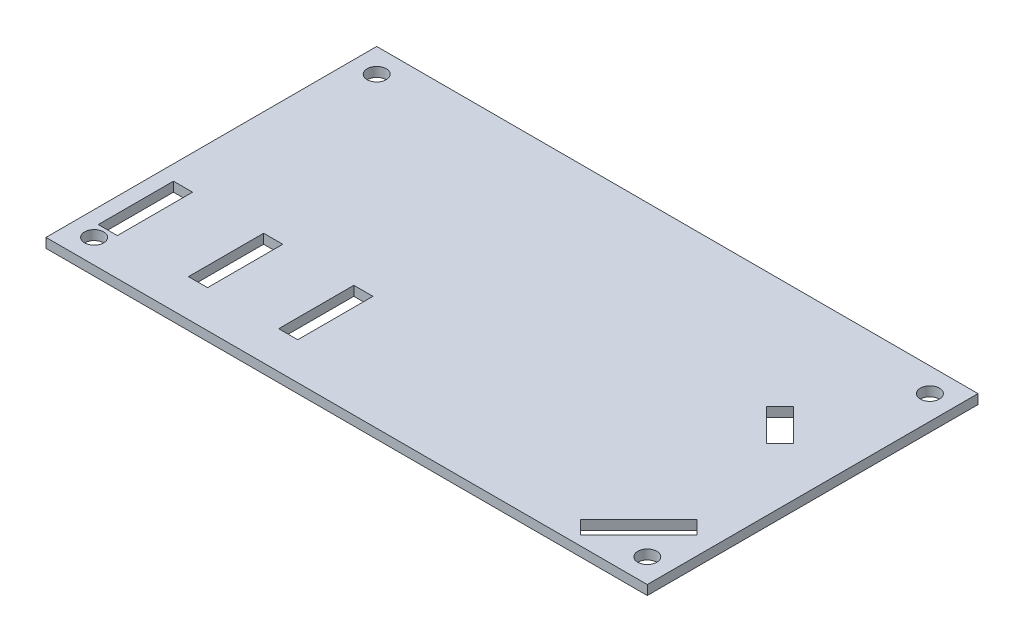
ISO-10303-21;
HEADER;
FILE_DESCRIPTION(('STEP AP214'),'2;1');
FILE_NAME('part.step','',(''),(''),'','','');
FILE_SCHEMA(('AUTOMOTIVE_DESIGN { 1 0 10303 214 1 1 1 1 }'));
ENDSEC;
DATA;
#1=APPLICATION_CONTEXT('core data for automotive mechanical design processes');
#2=APPLICATION_PROTOCOL_DEFINITION('international standard','automotive_design',2000,#1);
#3=PRODUCT_CONTEXT('',#1,'mechanical');
#4=PRODUCT('Part','Part','',(#3));
#5=PRODUCT_RELATED_PRODUCT_CATEGORY('part','',(#4));
#6=PRODUCT_DEFINITION_FORMATION('','',#4);
#7=PRODUCT_DEFINITION_CONTEXT('part definition',#1,'design');
#8=PRODUCT_DEFINITION('design','',#6,#7);
#9=PRODUCT_DEFINITION_SHAPE('','',#8);
#10=(LENGTH_UNIT() NAMED_UNIT(*) SI_UNIT(.MILLI.,.METRE.));
#11=(NAMED_UNIT(*) PLANE_ANGLE_UNIT() SI_UNIT($,.RADIAN.));
#12=(NAMED_UNIT(*) SI_UNIT($,.STERADIAN.) SOLID_ANGLE_UNIT());
#13=UNCERTAINTY_MEASURE_WITH_UNIT(LENGTH_MEASURE(1.E-05),#10,'distance_accuracy_value','');
#14=(GEOMETRIC_REPRESENTATION_CONTEXT(3) GLOBAL_UNCERTAINTY_ASSIGNED_CONTEXT((#13)) GLOBAL_UNIT_ASSIGNED_CONTEXT((#10,
#11,#12)) REPRESENTATION_CONTEXT('',''));
#15=CARTESIAN_POINT('',(0.,0.,0.));
#16=DIRECTION('',(0.,0.,1.));
#17=DIRECTION('',(1.,0.,0.));
#18=AXIS2_PLACEMENT_3D('',#15,#16,#17);
#19=CARTESIAN_POINT('',(65.,-0.00100000000000013,-12.3891811277915));
#20=DIRECTION('',(0.,0.,1.));
#21=DIRECTION('',(1.,0.,0.));
#22=AXIS2_PLACEMENT_3D('',#19,#20,#21);
#23=PLANE('',#22);
#24=DIRECTION('',(0.,1.,0.));
#25=VECTOR('',#24,1.);
#26=CARTESIAN_POINT('',(65.,-0.00100000000000013,-12.3891811277915));
#27=LINE('',#26,#25);
#28=CARTESIAN_POINT('',(65.,0.,-12.3891811277915));
#29=VERTEX_POINT('',#28);
#30=CARTESIAN_POINT('',(65.,3.175,-12.3891811277915));
#31=VERTEX_POINT('',#30);
#32=EDGE_CURVE('E405',#29,#31,#27,.T.);
#33=ORIENTED_EDGE('',*,*,#32,.T.);
#34=DIRECTION('',(1.,0.,0.));
#35=VECTOR('',#34,1.);
#36=CARTESIAN_POINT('',(65.,3.175,-12.3891811277915));
#37=LINE('',#36,#35);
#38=CARTESIAN_POINT('',(71.35,3.175,-12.3891811277915));
#39=VERTEX_POINT('',#38);
#40=EDGE_CURVE('E394',#31,#39,#37,.T.);
#41=ORIENTED_EDGE('',*,*,#40,.T.);
#42=DIRECTION('',(0.,1.,0.));
#43=VECTOR('',#42,1.);
#44=CARTESIAN_POINT('',(71.35,-0.00100000000000013,-12.3891811277915));
#45=LINE('',#44,#43);
#46=CARTESIAN_POINT('',(71.35,0.,-12.3891811277915));
#47=VERTEX_POINT('',#46);
#48=EDGE_CURVE('E11',#47,#39,#45,.T.);
#49=ORIENTED_EDGE('',*,*,#48,.F.);
#50=DIRECTION('',(1.,0.,0.));
#51=VECTOR('',#50,1.);
#52=CARTESIAN_POINT('',(65.,0.,-12.3891811277915));
#53=LINE('',#52,#51);
#54=EDGE_CURVE('E398',#29,#47,#53,.T.);
#55=ORIENTED_EDGE('',*,*,#54,.F.);
#56=EDGE_LOOP('',(#33,#41,#49,#55));
#57=FACE_BOUND('',#56,.T.);
#58=ADVANCED_FACE('F33',(#57),#23,.F.);
#59=CARTESIAN_POINT('',(71.35,-0.00100000000000013,-37.3891811277915));
#60=DIRECTION('',(1.,0.,0.));
#61=DIRECTION('',(0.,0.,-1.));
#62=AXIS2_PLACEMENT_3D('',#59,#60,#61);
#63=PLANE('',#62);
#64=ORIENTED_EDGE('',*,*,#48,.T.);
#65=DIRECTION('',(0.,0.,-1.));
#66=VECTOR('',#65,1.);
#67=CARTESIAN_POINT('',(71.35,3.175,-37.3891811277915));
#68=LINE('',#67,#66);
#69=CARTESIAN_POINT('',(71.35,3.175,-37.3891811277915));
#70=VERTEX_POINT('',#69);
#71=EDGE_CURVE('E391',#39,#70,#68,.T.);
#72=ORIENTED_EDGE('',*,*,#71,.T.);
#73=DIRECTION('',(0.,1.,0.));
#74=VECTOR('',#73,1.);
#75=CARTESIAN_POINT('',(71.35,-0.00100000000000013,-37.3891811277915));
#76=LINE('',#75,#74);
#77=CARTESIAN_POINT('',(71.35,0.,-37.3891811277915));
#78=VERTEX_POINT('',#77);
#79=EDGE_CURVE('E40',#78,#70,#76,.T.);
#80=ORIENTED_EDGE('',*,*,#79,.F.);
#81=DIRECTION('',(0.,0.,-1.));
#82=VECTOR('',#81,1.);
#83=CARTESIAN_POINT('',(71.35,0.,-37.3891811277915));
#84=LINE('',#83,#82);
#85=EDGE_CURVE('E54',#47,#78,#84,.T.);
#86=ORIENTED_EDGE('',*,*,#85,.F.);
#87=EDGE_LOOP('',(#64,#72,#80,#86));
#88=FACE_BOUND('',#87,.T.);
#89=ADVANCED_FACE('F413',(#88),#63,.F.);
#90=CARTESIAN_POINT('',(65.,-0.00100000000000013,-37.3891811277915));
#91=DIRECTION('',(0.,0.,-1.));
#92=DIRECTION('',(-1.,0.,0.));
#93=AXIS2_PLACEMENT_3D('',#90,#91,#92);
#94=PLANE('',#93);
#95=ORIENTED_EDGE('',*,*,#79,.T.);
#96=DIRECTION('',(-1.,0.,0.));
#97=VECTOR('',#96,1.);
#98=CARTESIAN_POINT('',(65.,3.175,-37.3891811277915));
#99=LINE('',#98,#97);
#100=CARTESIAN_POINT('',(65.,3.175,-37.3891811277915));
#101=VERTEX_POINT('',#100);
#102=EDGE_CURVE('E388',#70,#101,#99,.T.);
#103=ORIENTED_EDGE('',*,*,#102,.T.);
#104=DIRECTION('',(0.,1.,0.));
#105=VECTOR('',#104,1.);
#106=CARTESIAN_POINT('',(65.,-0.00100000000000013,-37.3891811277915));
#107=LINE('',#106,#105);
#108=CARTESIAN_POINT('',(65.,0.,-37.3891811277915));
#109=VERTEX_POINT('',#108);
#110=EDGE_CURVE('E403',#109,#101,#107,.T.);
#111=ORIENTED_EDGE('',*,*,#110,.F.);
#112=DIRECTION('',(-1.,0.,0.));
#113=VECTOR('',#112,1.);
#114=CARTESIAN_POINT('',(65.,0.,-37.3891811277915));
#115=LINE('',#114,#113);
#116=EDGE_CURVE('E401',#78,#109,#115,.T.);
#117=ORIENTED_EDGE('',*,*,#116,.F.);
#118=EDGE_LOOP('',(#95,#103,#111,#117));
#119=FACE_BOUND('',#118,.T.);
#120=ADVANCED_FACE('F410',(#119),#94,.F.);
#121=CARTESIAN_POINT('',(65.,-0.00100000000000013,-37.3891811277915));
#122=DIRECTION('',(-1.,0.,0.));
#123=DIRECTION('',(0.,0.,1.));
#124=AXIS2_PLACEMENT_3D('',#121,#122,#123);
#125=PLANE('',#124);
#126=ORIENTED_EDGE('',*,*,#110,.T.);
#127=DIRECTION('',(0.,0.,1.));
#128=VECTOR('',#127,1.);
#129=CARTESIAN_POINT('',(65.,3.175,-37.3891811277915));
#130=LINE('',#129,#128);
#131=EDGE_CURVE('E376',#101,#31,#130,.T.);
#132=ORIENTED_EDGE('',*,*,#131,.T.);
#133=ORIENTED_EDGE('',*,*,#32,.F.);
#134=DIRECTION('',(0.,0.,1.));
#135=VECTOR('',#134,1.);
#136=CARTESIAN_POINT('',(65.,0.,-37.3891811277915));
#137=LINE('',#136,#135);
#138=EDGE_CURVE('E47',#109,#29,#137,.T.);
#139=ORIENTED_EDGE('',*,*,#138,.F.);
#140=EDGE_LOOP('',(#126,#132,#133,#139));
#141=FACE_BOUND('',#140,.T.);
#142=ADVANCED_FACE('F419',(#141),#125,.F.);
#143=CARTESIAN_POINT('',(0.,3.175,0.));
#144=DIRECTION('',(1.,0.,0.));
#145=DIRECTION('',(0.,0.,-1.));
#146=AXIS2_PLACEMENT_3D('',#143,#144,#145);
#147=PLANE('',#146);
#148=DIRECTION('',(0.,0.,1.));
#149=VECTOR('',#148,1.);
#150=CARTESIAN_POINT('',(0.,0.,0.));
#151=LINE('',#150,#149);
#152=CARTESIAN_POINT('',(0.,0.,-110.));
#153=VERTEX_POINT('',#152);
#154=CARTESIAN_POINT('',(0.,0.,0.));
#155=VERTEX_POINT('',#154);
#156=EDGE_CURVE('E346',#153,#155,#151,.T.);
#157=ORIENTED_EDGE('',*,*,#156,.T.);
#158=DIRECTION('',(0.,-1.,0.));
#159=VECTOR('',#158,1.);
#160=CARTESIAN_POINT('',(0.,3.175,0.));
#161=LINE('',#160,#159);
#162=CARTESIAN_POINT('',(0.,3.175,0.));
#163=VERTEX_POINT('',#162);
#164=EDGE_CURVE('E373',#163,#155,#161,.T.);
#165=ORIENTED_EDGE('',*,*,#164,.F.);
#166=DIRECTION('',(0.,0.,1.));
#167=VECTOR('',#166,1.);
#168=CARTESIAN_POINT('',(0.,3.175,0.));
#169=LINE('',#168,#167);
#170=CARTESIAN_POINT('',(0.,3.175,-110.));
#171=VERTEX_POINT('',#170);
#172=EDGE_CURVE('E347',#171,#163,#169,.T.);
#173=ORIENTED_EDGE('',*,*,#172,.F.);
#174=DIRECTION('',(0.,-1.,0.));
#175=VECTOR('',#174,1.);
#176=CARTESIAN_POINT('',(0.,3.175,-110.));
#177=LINE('',#176,#175);
#178=EDGE_CURVE('E357',#171,#153,#177,.T.);
#179=ORIENTED_EDGE('',*,*,#178,.T.);
#180=EDGE_LOOP('',(#157,#165,#173,#179));
#181=FACE_BOUND('',#180,.T.);
#182=ADVANCED_FACE('F421',(#181),#147,.F.);
#183=CARTESIAN_POINT('',(0.,3.175,0.));
#184=DIRECTION('',(0.,0.,-1.));
#185=DIRECTION('',(-1.,0.,0.));
#186=AXIS2_PLACEMENT_3D('',#183,#184,#185);
#187=PLANE('',#186);
#188=DIRECTION('',(1.,0.,0.));
#189=VECTOR('',#188,1.);
#190=CARTESIAN_POINT('',(0.,0.,0.));
#191=LINE('',#190,#189);
#192=CARTESIAN_POINT('',(200.,0.,0.));
#193=VERTEX_POINT('',#192);
#194=EDGE_CURVE('E360',#155,#193,#191,.T.);
#195=ORIENTED_EDGE('',*,*,#194,.T.);
#196=DIRECTION('',(0.,-1.,0.));
#197=VECTOR('',#196,1.);
#198=CARTESIAN_POINT('',(200.,3.175,0.));
#199=LINE('',#198,#197);
#200=CARTESIAN_POINT('',(200.,3.175,0.));
#201=VERTEX_POINT('',#200);
#202=EDGE_CURVE('E370',#201,#193,#199,.T.);
#203=ORIENTED_EDGE('',*,*,#202,.F.);
#204=DIRECTION('',(1.,0.,0.));
#205=VECTOR('',#204,1.);
#206=CARTESIAN_POINT('',(0.,3.175,0.));
#207=LINE('',#206,#205);
#208=EDGE_CURVE('E350',#163,#201,#207,.T.);
#209=ORIENTED_EDGE('',*,*,#208,.F.);
#210=ORIENTED_EDGE('',*,*,#164,.T.);
#211=EDGE_LOOP('',(#195,#203,#209,#210));
#212=FACE_BOUND('',#211,.T.);
#213=ADVANCED_FACE('F427',(#212),#187,.F.);
#214=CARTESIAN_POINT('',(200.,3.175,0.));
#215=DIRECTION('',(-1.,0.,0.));
#216=DIRECTION('',(0.,0.,1.));
#217=AXIS2_PLACEMENT_3D('',#214,#215,#216);
#218=PLANE('',#217);
#219=DIRECTION('',(0.,0.,-1.));
#220=VECTOR('',#219,1.);
#221=CARTESIAN_POINT('',(200.,0.,0.));
#222=LINE('',#221,#220);
#223=CARTESIAN_POINT('',(200.,0.,-110.));
#224=VERTEX_POINT('',#223);
#225=EDGE_CURVE('E362',#193,#224,#222,.T.);
#226=ORIENTED_EDGE('',*,*,#225,.T.);
#227=DIRECTION('',(0.,-1.,0.));
#228=VECTOR('',#227,1.);
#229=CARTESIAN_POINT('',(200.,3.175,-110.));
#230=LINE('',#229,#228);
#231=CARTESIAN_POINT('',(200.,3.175,-110.));
#232=VERTEX_POINT('',#231);
#233=EDGE_CURVE('E367',#232,#224,#230,.T.);
#234=ORIENTED_EDGE('',*,*,#233,.F.);
#235=DIRECTION('',(0.,0.,-1.));
#236=VECTOR('',#235,1.);
#237=CARTESIAN_POINT('',(200.,3.175,0.));
#238=LINE('',#237,#236);
#239=EDGE_CURVE('E353',#201,#232,#238,.T.);
#240=ORIENTED_EDGE('',*,*,#239,.F.);
#241=ORIENTED_EDGE('',*,*,#202,.T.);
#242=EDGE_LOOP('',(#226,#234,#240,#241));
#243=FACE_BOUND('',#242,.T.);
#244=ADVANCED_FACE('F573',(#243),#218,.F.);
#245=CARTESIAN_POINT('',(0.,3.175,-110.));
#246=DIRECTION('',(0.,0.,1.));
#247=DIRECTION('',(1.,0.,0.));
#248=AXIS2_PLACEMENT_3D('',#245,#246,#247);
#249=PLANE('',#248);
#250=DIRECTION('',(-1.,0.,0.));
#251=VECTOR('',#250,1.);
#252=CARTESIAN_POINT('',(0.,0.,-110.));
#253=LINE('',#252,#251);
#254=EDGE_CURVE('E351',#224,#153,#253,.T.);
#255=ORIENTED_EDGE('',*,*,#254,.T.);
#256=ORIENTED_EDGE('',*,*,#178,.F.);
#257=DIRECTION('',(-1.,0.,0.));
#258=VECTOR('',#257,1.);
#259=CARTESIAN_POINT('',(0.,3.175,-110.));
#260=LINE('',#259,#258);
#261=EDGE_CURVE('E355',#232,#171,#260,.T.);
#262=ORIENTED_EDGE('',*,*,#261,.F.);
#263=ORIENTED_EDGE('',*,*,#233,.T.);
#264=EDGE_LOOP('',(#255,#256,#262,#263));
#265=FACE_BOUND('',#264,.T.);
#266=ADVANCED_FACE('F456',(#265),#249,.F.);
#267=CARTESIAN_POINT('',(0.,3.175,0.));
#268=DIRECTION('',(0.,-1.,0.));
#269=DIRECTION('',(0.,0.,-1.));
#270=AXIS2_PLACEMENT_3D('',#267,#268,#269);
#271=PLANE('',#270);
#272=DIRECTION('',(1.,0.,0.));
#273=VECTOR('',#272,1.);
#274=CARTESIAN_POINT('',(35.,3.175,-12.3891811277915));
#275=LINE('',#274,#273);
#276=CARTESIAN_POINT('',(35.,3.175,-12.3891811277915));
#277=VERTEX_POINT('',#276);
#278=CARTESIAN_POINT('',(41.35,3.175,-12.3891811277915));
#279=VERTEX_POINT('',#278);
#280=EDGE_CURVE('E195',#277,#279,#275,.T.);
#281=ORIENTED_EDGE('',*,*,#280,.F.);
#282=DIRECTION('',(0.,0.,1.));
#283=VECTOR('',#282,1.);
#284=CARTESIAN_POINT('',(35.,3.175,-37.3891811277915));
#285=LINE('',#284,#283);
#286=CARTESIAN_POINT('',(35.,3.175,-37.3891811277915));
#287=VERTEX_POINT('',#286);
#288=EDGE_CURVE('E231',#287,#277,#285,.T.);
#289=ORIENTED_EDGE('',*,*,#288,.F.);
#290=DIRECTION('',(-1.,0.,0.));
#291=VECTOR('',#290,1.);
#292=CARTESIAN_POINT('',(35.,3.175,-37.3891811277915));
#293=LINE('',#292,#291);
#294=CARTESIAN_POINT('',(41.35,3.175,-37.3891811277915));
#295=VERTEX_POINT('',#294);
#296=EDGE_CURVE('E217',#295,#287,#293,.T.);
#297=ORIENTED_EDGE('',*,*,#296,.F.);
#298=DIRECTION('',(0.,0.,-1.));
#299=VECTOR('',#298,1.);
#300=CARTESIAN_POINT('',(41.35,3.175,-37.3891811277915));
#301=LINE('',#300,#299);
#302=EDGE_CURVE('E209',#279,#295,#301,.T.);
#303=ORIENTED_EDGE('',*,*,#302,.F.);
#304=EDGE_LOOP('',(#281,#289,#297,#303));
#305=FACE_BOUND('',#304,.T.);
#306=CARTESIAN_POINT('',(8.,3.175,-7.99999999999999));
#307=DIRECTION('',(0.,1.,0.));
#308=DIRECTION('',(0.,0.,-1.));
#309=AXIS2_PLACEMENT_3D('',#306,#307,#308);
#310=CIRCLE('',#309,3.175);
#311=CARTESIAN_POINT('',(8.,3.175,-11.175));
#312=VERTEX_POINT('',#311);
#313=EDGE_CURVE('E236',#312,#312,#310,.T.);
#314=ORIENTED_EDGE('',*,*,#313,.F.);
#315=EDGE_LOOP('',(#314));
#316=FACE_BOUND('',#315,.T.);
#317=CARTESIAN_POINT('',(192.,3.175,-7.99999999999999));
#318=DIRECTION('',(0.,1.,0.));
#319=DIRECTION('',(0.,0.,1.));
#320=AXIS2_PLACEMENT_3D('',#317,#318,#319);
#321=CIRCLE('',#320,3.175);
#322=CARTESIAN_POINT('',(192.,3.175,-4.825));
#323=VERTEX_POINT('',#322);
#324=EDGE_CURVE('E241',#323,#323,#321,.T.);
#325=ORIENTED_EDGE('',*,*,#324,.F.);
#326=EDGE_LOOP('',(#325));
#327=FACE_BOUND('',#326,.T.);
#328=CARTESIAN_POINT('',(192.,3.175,-102.));
#329=DIRECTION('',(0.,1.,0.));
#330=DIRECTION('',(0.,0.,-1.));
#331=AXIS2_PLACEMENT_3D('',#328,#329,#330);
#332=CIRCLE('',#331,3.175);
#333=CARTESIAN_POINT('',(192.,3.175,-105.175));
#334=VERTEX_POINT('',#333);
#335=EDGE_CURVE('E237',#334,#334,#332,.T.);
#336=ORIENTED_EDGE('',*,*,#335,.F.);
#337=EDGE_LOOP('',(#336));
#338=FACE_BOUND('',#337,.T.);
#339=CARTESIAN_POINT('',(8.,3.175,-102.));
#340=DIRECTION('',(0.,1.,0.));
#341=DIRECTION('',(0.,0.,1.));
#342=AXIS2_PLACEMENT_3D('',#339,#340,#341);
#343=CIRCLE('',#342,3.175);
#344=CARTESIAN_POINT('',(8.,3.175,-98.825));
#345=VERTEX_POINT('',#344);
#346=EDGE_CURVE('E240',#345,#345,#343,.T.);
#347=ORIENTED_EDGE('',*,*,#346,.F.);
#348=EDGE_LOOP('',(#347));
#349=FACE_BOUND('',#348,.T.);
#350=DIRECTION('',(1.,0.,0.));
#351=VECTOR('',#350,1.);
#352=CARTESIAN_POINT('',(5.,3.175,-12.3891811277915));
#353=LINE('',#352,#351);
#354=CARTESIAN_POINT('',(5.,3.175,-12.3891811277915));
#355=VERTEX_POINT('',#354);
#356=CARTESIAN_POINT('',(11.35,3.175,-12.3891811277915));
#357=VERTEX_POINT('',#356);
#358=EDGE_CURVE('E261',#355,#357,#353,.T.);
#359=ORIENTED_EDGE('',*,*,#358,.F.);
#360=DIRECTION('',(0.,0.,1.));
#361=VECTOR('',#360,1.);
#362=CARTESIAN_POINT('',(5.,3.175,-37.3891811277915));
#363=LINE('',#362,#361);
#364=CARTESIAN_POINT('',(5.,3.175,-37.3891811277915));
#365=VERTEX_POINT('',#364);
#366=EDGE_CURVE('E259',#365,#355,#363,.T.);
#367=ORIENTED_EDGE('',*,*,#366,.F.);
#368=DIRECTION('',(-1.,0.,0.));
#369=VECTOR('',#368,1.);
#370=CARTESIAN_POINT('',(5.,3.175,-37.3891811277915));
#371=LINE('',#370,#369);
#372=CARTESIAN_POINT('',(11.35,3.175,-37.3891811277915));
#373=VERTEX_POINT('',#372);
#374=EDGE_CURVE('E267',#373,#365,#371,.T.);
#375=ORIENTED_EDGE('',*,*,#374,.F.);
#376=DIRECTION('',(0.,0.,-1.));
#377=VECTOR('',#376,1.);
#378=CARTESIAN_POINT('',(11.35,3.175,-37.3891811277915));
#379=LINE('',#378,#377);
#380=EDGE_CURVE('E264',#357,#373,#379,.T.);
#381=ORIENTED_EDGE('',*,*,#380,.F.);
#382=EDGE_LOOP('',(#359,#367,#375,#381));
#383=FACE_BOUND('',#382,.T.);
#384=DIRECTION('',(0.70710678118648,0.,0.707106781186615));
#385=VECTOR('',#384,1.);
#386=CARTESIAN_POINT('',(168.509871939466,3.175,-71.1518289963231));
#387=LINE('',#386,#385);
#388=CARTESIAN_POINT('',(168.509871939466,3.175,-71.1518289963231));
#389=VERTEX_POINT('',#388);
#390=CARTESIAN_POINT('',(179.151828996322,3.175,-60.5098719394645));
#391=VERTEX_POINT('',#390);
#392=EDGE_CURVE('E293',#389,#391,#387,.T.);
#393=ORIENTED_EDGE('',*,*,#392,.F.);
#394=DIRECTION('',(-0.707106781186541,0.,0.707106781186554));
#395=VECTOR('',#394,1.);
#396=CARTESIAN_POINT('',(173.,3.175,-75.6419570568575));
#397=LINE('',#396,#395);
#398=CARTESIAN_POINT('',(173.,3.175,-75.6419570568575));
#399=VERTEX_POINT('',#398);
#400=EDGE_CURVE('E291',#399,#389,#397,.T.);
#401=ORIENTED_EDGE('',*,*,#400,.F.);
#402=DIRECTION('',(-0.707106781186552,0.,-0.707106781186543));
#403=VECTOR('',#402,1.);
#404=CARTESIAN_POINT('',(183.641957056858,3.175,-65.));
#405=LINE('',#404,#403);
#406=CARTESIAN_POINT('',(183.641957056858,3.175,-65.));
#407=VERTEX_POINT('',#406);
#408=EDGE_CURVE('E299',#407,#399,#405,.T.);
#409=ORIENTED_EDGE('',*,*,#408,.F.);
#410=DIRECTION('',(0.707106781186546,0.,-0.707106781186549));
#411=VECTOR('',#410,1.);
#412=CARTESIAN_POINT('',(179.151828996322,3.175,-60.5098719394645));
#413=LINE('',#412,#411);
#414=EDGE_CURVE('E296',#391,#407,#413,.T.);
#415=ORIENTED_EDGE('',*,*,#414,.F.);
#416=EDGE_LOOP('',(#393,#401,#409,#415));
#417=FACE_BOUND('',#416,.T.);
#418=DIRECTION('',(-0.707106781186547,0.,0.707106781186548));
#419=VECTOR('',#418,1.);
#420=CARTESIAN_POINT('',(189.509871939465,3.175,-26.9578560038893));
#421=LINE('',#420,#419);
#422=CARTESIAN_POINT('',(189.509871939465,3.175,-26.9578560038893));
#423=VERTEX_POINT('',#422);
#424=CARTESIAN_POINT('',(170.135146134954,3.175,-7.58313019937795));
#425=VERTEX_POINT('',#424);
#426=EDGE_CURVE('E325',#423,#425,#421,.T.);
#427=ORIENTED_EDGE('',*,*,#426,.F.);
#428=DIRECTION('',(-0.707106781186546,0.,-0.707106781186549));
#429=VECTOR('',#428,1.);
#430=CARTESIAN_POINT('',(194.,3.175,-22.4677279433546));
#431=LINE('',#430,#429);
#432=CARTESIAN_POINT('',(194.,3.175,-22.4677279433546));
#433=VERTEX_POINT('',#432);
#434=EDGE_CURVE('E323',#433,#423,#431,.T.);
#435=ORIENTED_EDGE('',*,*,#434,.F.);
#436=DIRECTION('',(0.707106781186551,0.,-0.707106781186544));
#437=VECTOR('',#436,1.);
#438=CARTESIAN_POINT('',(194.,3.175,-22.4677279433546));
#439=LINE('',#438,#437);
#440=CARTESIAN_POINT('',(174.625274195489,3.175,-3.09300213884334));
#441=VERTEX_POINT('',#440);
#442=EDGE_CURVE('E331',#441,#433,#439,.T.);
#443=ORIENTED_EDGE('',*,*,#442,.F.);
#444=DIRECTION('',(0.707106781186544,0.,0.707106781186551));
#445=VECTOR('',#444,1.);
#446=CARTESIAN_POINT('',(170.135146134954,3.175,-7.58313019937795));
#447=LINE('',#446,#445);
#448=EDGE_CURVE('E328',#425,#441,#447,.T.);
#449=ORIENTED_EDGE('',*,*,#448,.F.);
#450=EDGE_LOOP('',(#427,#435,#443,#449));
#451=FACE_BOUND('',#450,.T.);
#452=ORIENTED_EDGE('',*,*,#172,.T.);
#453=ORIENTED_EDGE('',*,*,#208,.T.);
#454=ORIENTED_EDGE('',*,*,#239,.T.);
#455=ORIENTED_EDGE('',*,*,#261,.T.);
#456=EDGE_LOOP('',(#452,#453,#454,#455));
#457=FACE_BOUND('',#456,.T.);
#458=ORIENTED_EDGE('',*,*,#131,.F.);
#459=ORIENTED_EDGE('',*,*,#102,.F.);
#460=ORIENTED_EDGE('',*,*,#71,.F.);
#461=ORIENTED_EDGE('',*,*,#40,.F.);
#462=EDGE_LOOP('',(#458,#459,#460,#461));
#463=FACE_BOUND('',#462,.T.);
#464=ADVANCED_FACE('F215',(#305,#316,#327,#338,#349,#383,#417,#451,#457,#463),#271,.F.);
#465=CARTESIAN_POINT('',(0.,0.,0.));
#466=DIRECTION('',(0.,-1.,0.));
#467=DIRECTION('',(0.,0.,-1.));
#468=AXIS2_PLACEMENT_3D('',#465,#466,#467);
#469=PLANE('',#468);
#470=DIRECTION('',(0.,0.,1.));
#471=VECTOR('',#470,1.);
#472=CARTESIAN_POINT('',(35.,0.,-37.3891811277915));
#473=LINE('',#472,#471);
#474=CARTESIAN_POINT('',(35.,0.,-37.3891811277915));
#475=VERTEX_POINT('',#474);
#476=CARTESIAN_POINT('',(35.,0.,-12.3891811277915));
#477=VERTEX_POINT('',#476);
#478=EDGE_CURVE('E233',#475,#477,#473,.T.);
#479=ORIENTED_EDGE('',*,*,#478,.T.);
#480=DIRECTION('',(1.,0.,0.));
#481=VECTOR('',#480,1.);
#482=CARTESIAN_POINT('',(35.,0.,-12.3891811277915));
#483=LINE('',#482,#481);
#484=CARTESIAN_POINT('',(41.35,0.,-12.3891811277915));
#485=VERTEX_POINT('',#484);
#486=EDGE_CURVE('E205',#477,#485,#483,.T.);
#487=ORIENTED_EDGE('',*,*,#486,.T.);
#488=DIRECTION('',(0.,0.,-1.));
#489=VECTOR('',#488,1.);
#490=CARTESIAN_POINT('',(41.35,0.,-37.3891811277915));
#491=LINE('',#490,#489);
#492=CARTESIAN_POINT('',(41.35,0.,-37.3891811277915));
#493=VERTEX_POINT('',#492);
#494=EDGE_CURVE('E212',#485,#493,#491,.T.);
#495=ORIENTED_EDGE('',*,*,#494,.T.);
#496=DIRECTION('',(-1.,0.,0.));
#497=VECTOR('',#496,1.);
#498=CARTESIAN_POINT('',(35.,0.,-37.3891811277915));
#499=LINE('',#498,#497);
#500=EDGE_CURVE('E228',#493,#475,#499,.T.);
#501=ORIENTED_EDGE('',*,*,#500,.T.);
#502=EDGE_LOOP('',(#479,#487,#495,#501));
#503=FACE_BOUND('',#502,.T.);
#504=CARTESIAN_POINT('',(8.,0.,-7.99999999999999));
#505=DIRECTION('',(0.,-1.,0.));
#506=DIRECTION('',(0.,0.,-1.));
#507=AXIS2_PLACEMENT_3D('',#504,#505,#506);
#508=CIRCLE('',#507,3.175);
#509=CARTESIAN_POINT('',(8.,0.,-11.175));
#510=VERTEX_POINT('',#509);
#511=EDGE_CURVE('E253',#510,#510,#508,.T.);
#512=ORIENTED_EDGE('',*,*,#511,.F.);
#513=EDGE_LOOP('',(#512));
#514=FACE_BOUND('',#513,.T.);
#515=CARTESIAN_POINT('',(192.,0.,-7.99999999999999));
#516=DIRECTION('',(0.,-1.,0.));
#517=DIRECTION('',(0.,0.,-1.));
#518=AXIS2_PLACEMENT_3D('',#515,#516,#517);
#519=CIRCLE('',#518,3.175);
#520=CARTESIAN_POINT('',(192.,0.,-11.175));
#521=VERTEX_POINT('',#520);
#522=EDGE_CURVE('E382',#521,#521,#519,.T.);
#523=ORIENTED_EDGE('',*,*,#522,.F.);
#524=EDGE_LOOP('',(#523));
#525=FACE_BOUND('',#524,.T.);
#526=CARTESIAN_POINT('',(192.,0.,-102.));
#527=DIRECTION('',(0.,-1.,0.));
#528=DIRECTION('',(0.,0.,-1.));
#529=AXIS2_PLACEMENT_3D('',#526,#527,#528);
#530=CIRCLE('',#529,3.175);
#531=CARTESIAN_POINT('',(192.,0.,-105.175));
#532=VERTEX_POINT('',#531);
#533=EDGE_CURVE('E379',#532,#532,#530,.T.);
#534=ORIENTED_EDGE('',*,*,#533,.F.);
#535=EDGE_LOOP('',(#534));
#536=FACE_BOUND('',#535,.T.);
#537=CARTESIAN_POINT('',(8.,0.,-102.));
#538=DIRECTION('',(0.,-1.,0.));
#539=DIRECTION('',(0.,0.,-1.));
#540=AXIS2_PLACEMENT_3D('',#537,#538,#539);
#541=CIRCLE('',#540,3.175);
#542=CARTESIAN_POINT('',(8.,0.,-105.175));
#543=VERTEX_POINT('',#542);
#544=EDGE_CURVE('E248',#543,#543,#541,.T.);
#545=ORIENTED_EDGE('',*,*,#544,.F.);
#546=EDGE_LOOP('',(#545));
#547=FACE_BOUND('',#546,.T.);
#548=DIRECTION('',(0.,0.,1.));
#549=VECTOR('',#548,1.);
#550=CARTESIAN_POINT('',(5.,0.,-37.3891811277915));
#551=LINE('',#550,#549);
#552=CARTESIAN_POINT('',(5.,0.,-37.3891811277915));
#553=VERTEX_POINT('',#552);
#554=CARTESIAN_POINT('',(5.,0.,-12.3891811277915));
#555=VERTEX_POINT('',#554);
#556=EDGE_CURVE('E256',#553,#555,#551,.T.);
#557=ORIENTED_EDGE('',*,*,#556,.T.);
#558=DIRECTION('',(1.,0.,0.));
#559=VECTOR('',#558,1.);
#560=CARTESIAN_POINT('',(5.,0.,-12.3891811277915));
#561=LINE('',#560,#559);
#562=CARTESIAN_POINT('',(11.35,0.,-12.3891811277915));
#563=VERTEX_POINT('',#562);
#564=EDGE_CURVE('E273',#555,#563,#561,.T.);
#565=ORIENTED_EDGE('',*,*,#564,.T.);
#566=DIRECTION('',(0.,0.,-1.));
#567=VECTOR('',#566,1.);
#568=CARTESIAN_POINT('',(11.35,0.,-37.3891811277915));
#569=LINE('',#568,#567);
#570=CARTESIAN_POINT('',(11.35,0.,-37.3891811277915));
#571=VERTEX_POINT('',#570);
#572=EDGE_CURVE('E249',#563,#571,#569,.T.);
#573=ORIENTED_EDGE('',*,*,#572,.T.);
#574=DIRECTION('',(-1.,0.,0.));
#575=VECTOR('',#574,1.);
#576=CARTESIAN_POINT('',(5.,0.,-37.3891811277915));
#577=LINE('',#576,#575);
#578=EDGE_CURVE('E252',#571,#553,#577,.T.);
#579=ORIENTED_EDGE('',*,*,#578,.T.);
#580=EDGE_LOOP('',(#557,#565,#573,#579));
#581=FACE_BOUND('',#580,.T.);
#582=DIRECTION('',(-0.707106781186541,0.,0.707106781186554));
#583=VECTOR('',#582,1.);
#584=CARTESIAN_POINT('',(173.,0.,-75.6419570568575));
#585=LINE('',#584,#583);
#586=CARTESIAN_POINT('',(173.,0.,-75.6419570568575));
#587=VERTEX_POINT('',#586);
#588=CARTESIAN_POINT('',(168.509871939466,0.,-71.1518289963231));
#589=VERTEX_POINT('',#588);
#590=EDGE_CURVE('E288',#587,#589,#585,.T.);
#591=ORIENTED_EDGE('',*,*,#590,.T.);
#592=DIRECTION('',(0.70710678118648,0.,0.707106781186615));
#593=VECTOR('',#592,1.);
#594=CARTESIAN_POINT('',(168.509871939466,0.,-71.1518289963231));
#595=LINE('',#594,#593);
#596=CARTESIAN_POINT('',(179.151828996322,0.,-60.5098719394645));
#597=VERTEX_POINT('',#596);
#598=EDGE_CURVE('E305',#589,#597,#595,.T.);
#599=ORIENTED_EDGE('',*,*,#598,.T.);
#600=DIRECTION('',(0.707106781186546,0.,-0.707106781186549));
#601=VECTOR('',#600,1.);
#602=CARTESIAN_POINT('',(179.151828996322,0.,-60.5098719394645));
#603=LINE('',#602,#601);
#604=CARTESIAN_POINT('',(183.641957056858,0.,-65.));
#605=VERTEX_POINT('',#604);
#606=EDGE_CURVE('E282',#597,#605,#603,.T.);
#607=ORIENTED_EDGE('',*,*,#606,.T.);
#608=DIRECTION('',(-0.707106781186552,0.,-0.707106781186543));
#609=VECTOR('',#608,1.);
#610=CARTESIAN_POINT('',(183.641957056858,0.,-65.));
#611=LINE('',#610,#609);
#612=EDGE_CURVE('E285',#605,#587,#611,.T.);
#613=ORIENTED_EDGE('',*,*,#612,.T.);
#614=EDGE_LOOP('',(#591,#599,#607,#613));
#615=FACE_BOUND('',#614,.T.);
#616=DIRECTION('',(-0.707106781186546,0.,-0.707106781186549));
#617=VECTOR('',#616,1.);
#618=CARTESIAN_POINT('',(194.,0.,-22.4677279433546));
#619=LINE('',#618,#617);
#620=CARTESIAN_POINT('',(194.,0.,-22.4677279433546));
#621=VERTEX_POINT('',#620);
#622=CARTESIAN_POINT('',(189.509871939465,0.,-26.9578560038893));
#623=VERTEX_POINT('',#622);
#624=EDGE_CURVE('E320',#621,#623,#619,.T.);
#625=ORIENTED_EDGE('',*,*,#624,.T.);
#626=DIRECTION('',(-0.707106781186547,0.,0.707106781186548));
#627=VECTOR('',#626,1.);
#628=CARTESIAN_POINT('',(189.509871939465,0.,-26.9578560038893));
#629=LINE('',#628,#627);
#630=CARTESIAN_POINT('',(170.135146134954,0.,-7.58313019937795));
#631=VERTEX_POINT('',#630);
#632=EDGE_CURVE('E337',#623,#631,#629,.T.);
#633=ORIENTED_EDGE('',*,*,#632,.T.);
#634=DIRECTION('',(0.707106781186544,0.,0.707106781186551));
#635=VECTOR('',#634,1.);
#636=CARTESIAN_POINT('',(170.135146134954,0.,-7.58313019937795));
#637=LINE('',#636,#635);
#638=CARTESIAN_POINT('',(174.625274195489,0.,-3.09300213884334));
#639=VERTEX_POINT('',#638);
#640=EDGE_CURVE('E314',#631,#639,#637,.T.);
#641=ORIENTED_EDGE('',*,*,#640,.T.);
#642=DIRECTION('',(0.707106781186551,0.,-0.707106781186544));
#643=VECTOR('',#642,1.);
#644=CARTESIAN_POINT('',(194.,0.,-22.4677279433546));
#645=LINE('',#644,#643);
#646=EDGE_CURVE('E317',#639,#621,#645,.T.);
#647=ORIENTED_EDGE('',*,*,#646,.T.);
#648=EDGE_LOOP('',(#625,#633,#641,#647));
#649=FACE_BOUND('',#648,.T.);
#650=ORIENTED_EDGE('',*,*,#156,.F.);
#651=ORIENTED_EDGE('',*,*,#254,.F.);
#652=ORIENTED_EDGE('',*,*,#225,.F.);
#653=ORIENTED_EDGE('',*,*,#194,.F.);
#654=EDGE_LOOP('',(#650,#651,#652,#653));
#655=FACE_BOUND('',#654,.T.);
#656=ORIENTED_EDGE('',*,*,#138,.T.);
#657=ORIENTED_EDGE('',*,*,#54,.T.);
#658=ORIENTED_EDGE('',*,*,#85,.T.);
#659=ORIENTED_EDGE('',*,*,#116,.T.);
#660=EDGE_LOOP('',(#656,#657,#658,#659));
#661=FACE_BOUND('',#660,.T.);
#662=ADVANCED_FACE('F455',(#503,#514,#525,#536,#547,#581,#615,#649,#655,#661),#469,.T.);
#663=CARTESIAN_POINT('',(194.,-0.00100000000000013,-22.4677279433546));
#664=DIRECTION('',(0.707106781186549,0.,-0.707106781186546));
#665=DIRECTION('',(-0.707106781186546,0.,-0.707106781186549));
#666=AXIS2_PLACEMENT_3D('',#663,#664,#665);
#667=PLANE('',#666);
#668=DIRECTION('',(0.,1.,0.));
#669=VECTOR('',#668,1.);
#670=CARTESIAN_POINT('',(194.,-0.00100000000000013,-22.4677279433546));
#671=LINE('',#670,#669);
#672=EDGE_CURVE('E335',#621,#433,#671,.T.);
#673=ORIENTED_EDGE('',*,*,#672,.T.);
#674=ORIENTED_EDGE('',*,*,#434,.T.);
#675=DIRECTION('',(0.,1.,0.));
#676=VECTOR('',#675,1.);
#677=CARTESIAN_POINT('',(189.509871939465,-0.00100000000000013,-26.9578560038893));
#678=LINE('',#677,#676);
#679=EDGE_CURVE('E334',#623,#423,#678,.T.);
#680=ORIENTED_EDGE('',*,*,#679,.F.);
#681=ORIENTED_EDGE('',*,*,#624,.F.);
#682=EDGE_LOOP('',(#673,#674,#680,#681));
#683=FACE_BOUND('',#682,.T.);
#684=ADVANCED_FACE('F467',(#683),#667,.F.);
#685=CARTESIAN_POINT('',(194.,-0.00100000000000013,-22.4677279433546));
#686=DIRECTION('',(0.707106781186544,0.,0.707106781186551));
#687=DIRECTION('',(0.707106781186551,0.,-0.707106781186544));
#688=AXIS2_PLACEMENT_3D('',#685,#686,#687);
#689=PLANE('',#688);
#690=DIRECTION('',(0.,1.,0.));
#691=VECTOR('',#690,1.);
#692=CARTESIAN_POINT('',(174.625274195489,-0.00100000000000013,-3.09300213884334));
#693=LINE('',#692,#691);
#694=EDGE_CURVE('E338',#639,#441,#693,.T.);
#695=ORIENTED_EDGE('',*,*,#694,.T.);
#696=ORIENTED_EDGE('',*,*,#442,.T.);
#697=ORIENTED_EDGE('',*,*,#672,.F.);
#698=ORIENTED_EDGE('',*,*,#646,.F.);
#699=EDGE_LOOP('',(#695,#696,#697,#698));
#700=FACE_BOUND('',#699,.T.);
#701=ADVANCED_FACE('F559',(#700),#689,.F.);
#702=CARTESIAN_POINT('',(170.135146134954,-0.00100000000000013,-7.58313019937795));
#703=DIRECTION('',(-0.707106781186551,0.,0.707106781186544));
#704=DIRECTION('',(0.707106781186544,0.,0.707106781186551));
#705=AXIS2_PLACEMENT_3D('',#702,#703,#704);
#706=PLANE('',#705);
#707=DIRECTION('',(0.,1.,0.));
#708=VECTOR('',#707,1.);
#709=CARTESIAN_POINT('',(170.135146134954,-0.00100000000000013,-7.58313019937795));
#710=LINE('',#709,#708);
#711=EDGE_CURVE('E340',#631,#425,#710,.T.);
#712=ORIENTED_EDGE('',*,*,#711,.T.);
#713=ORIENTED_EDGE('',*,*,#448,.T.);
#714=ORIENTED_EDGE('',*,*,#694,.F.);
#715=ORIENTED_EDGE('',*,*,#640,.F.);
#716=EDGE_LOOP('',(#712,#713,#714,#715));
#717=FACE_BOUND('',#716,.T.);
#718=ADVANCED_FACE('F562',(#717),#706,.F.);
#719=CARTESIAN_POINT('',(189.509871939465,-0.00100000000000013,-26.9578560038893));
#720=DIRECTION('',(-0.707106781186548,0.,-0.707106781186547));
#721=DIRECTION('',(-0.707106781186547,0.,0.707106781186548));
#722=AXIS2_PLACEMENT_3D('',#719,#720,#721);
#723=PLANE('',#722);
#724=ORIENTED_EDGE('',*,*,#679,.T.);
#725=ORIENTED_EDGE('',*,*,#426,.T.);
#726=ORIENTED_EDGE('',*,*,#711,.F.);
#727=ORIENTED_EDGE('',*,*,#632,.F.);
#728=EDGE_LOOP('',(#724,#725,#726,#727));
#729=FACE_BOUND('',#728,.T.);
#730=ADVANCED_FACE('F557',(#729),#723,.F.);
#731=CARTESIAN_POINT('',(173.,-0.00100000000000013,-75.6419570568575));
#732=DIRECTION('',(-0.707106781186554,0.,-0.707106781186541));
#733=DIRECTION('',(-0.707106781186541,0.,0.707106781186554));
#734=AXIS2_PLACEMENT_3D('',#731,#732,#733);
#735=PLANE('',#734);
#736=DIRECTION('',(0.,1.,0.));
#737=VECTOR('',#736,1.);
#738=CARTESIAN_POINT('',(173.,-0.00100000000000013,-75.6419570568575));
#739=LINE('',#738,#737);
#740=EDGE_CURVE('E303',#587,#399,#739,.T.);
#741=ORIENTED_EDGE('',*,*,#740,.T.);
#742=ORIENTED_EDGE('',*,*,#400,.T.);
#743=DIRECTION('',(0.,1.,0.));
#744=VECTOR('',#743,1.);
#745=CARTESIAN_POINT('',(168.509871939466,-0.00100000000000013,-71.1518289963231));
#746=LINE('',#745,#744);
#747=EDGE_CURVE('E302',#589,#389,#746,.T.);
#748=ORIENTED_EDGE('',*,*,#747,.F.);
#749=ORIENTED_EDGE('',*,*,#590,.F.);
#750=EDGE_LOOP('',(#741,#742,#748,#749));
#751=FACE_BOUND('',#750,.T.);
#752=ADVANCED_FACE('F547',(#751),#735,.F.);
#753=CARTESIAN_POINT('',(183.641957056858,-0.00100000000000013,-65.));
#754=DIRECTION('',(0.707106781186543,0.,-0.707106781186552));
#755=DIRECTION('',(-0.707106781186552,0.,-0.707106781186543));
#756=AXIS2_PLACEMENT_3D('',#753,#754,#755);
#757=PLANE('',#756);
#758=DIRECTION('',(0.,1.,0.));
#759=VECTOR('',#758,1.);
#760=CARTESIAN_POINT('',(183.641957056858,-0.00100000000000013,-65.));
#761=LINE('',#760,#759);
#762=EDGE_CURVE('E306',#605,#407,#761,.T.);
#763=ORIENTED_EDGE('',*,*,#762,.T.);
#764=ORIENTED_EDGE('',*,*,#408,.T.);
#765=ORIENTED_EDGE('',*,*,#740,.F.);
#766=ORIENTED_EDGE('',*,*,#612,.F.);
#767=EDGE_LOOP('',(#763,#764,#765,#766));
#768=FACE_BOUND('',#767,.T.);
#769=ADVANCED_FACE('F543',(#768),#757,.F.);
#770=CARTESIAN_POINT('',(179.151828996322,-0.00100000000000013,-60.5098719394645));
#771=DIRECTION('',(0.707106781186549,0.,0.707106781186546));
#772=DIRECTION('',(0.707106781186546,0.,-0.707106781186549));
#773=AXIS2_PLACEMENT_3D('',#770,#771,#772);
#774=PLANE('',#773);
#775=DIRECTION('',(0.,1.,0.));
#776=VECTOR('',#775,1.);
#777=CARTESIAN_POINT('',(179.151828996322,-0.00100000000000013,-60.5098719394645));
#778=LINE('',#777,#776);
#779=EDGE_CURVE('E308',#597,#391,#778,.T.);
#780=ORIENTED_EDGE('',*,*,#779,.T.);
#781=ORIENTED_EDGE('',*,*,#414,.T.);
#782=ORIENTED_EDGE('',*,*,#762,.F.);
#783=ORIENTED_EDGE('',*,*,#606,.F.);
#784=EDGE_LOOP('',(#780,#781,#782,#783));
#785=FACE_BOUND('',#784,.T.);
#786=ADVANCED_FACE('F546',(#785),#774,.F.);
#787=CARTESIAN_POINT('',(168.509871939466,-0.00100000000000013,-71.1518289963231));
#788=DIRECTION('',(-0.707106781186615,0.,0.70710678118648));
#789=DIRECTION('',(0.70710678118648,0.,0.707106781186615));
#790=AXIS2_PLACEMENT_3D('',#787,#788,#789);
#791=PLANE('',#790);
#792=ORIENTED_EDGE('',*,*,#747,.T.);
#793=ORIENTED_EDGE('',*,*,#392,.T.);
#794=ORIENTED_EDGE('',*,*,#779,.F.);
#795=ORIENTED_EDGE('',*,*,#598,.F.);
#796=EDGE_LOOP('',(#792,#793,#794,#795));
#797=FACE_BOUND('',#796,.T.);
#798=ADVANCED_FACE('F541',(#797),#791,.F.);
#799=CARTESIAN_POINT('',(5.,-0.00100000000000013,-37.3891811277915));
#800=DIRECTION('',(-1.,0.,0.));
#801=DIRECTION('',(0.,0.,1.));
#802=AXIS2_PLACEMENT_3D('',#799,#800,#801);
#803=PLANE('',#802);
#804=DIRECTION('',(0.,1.,0.));
#805=VECTOR('',#804,1.);
#806=CARTESIAN_POINT('',(5.,-0.00100000000000013,-37.3891811277915));
#807=LINE('',#806,#805);
#808=EDGE_CURVE('E271',#553,#365,#807,.T.);
#809=ORIENTED_EDGE('',*,*,#808,.T.);
#810=ORIENTED_EDGE('',*,*,#366,.T.);
#811=DIRECTION('',(0.,1.,0.));
#812=VECTOR('',#811,1.);
#813=CARTESIAN_POINT('',(5.,-0.00100000000000013,-12.3891811277915));
#814=LINE('',#813,#812);
#815=EDGE_CURVE('E270',#555,#355,#814,.T.);
#816=ORIENTED_EDGE('',*,*,#815,.F.);
#817=ORIENTED_EDGE('',*,*,#556,.F.);
#818=EDGE_LOOP('',(#809,#810,#816,#817));
#819=FACE_BOUND('',#818,.T.);
#820=ADVANCED_FACE('F531',(#819),#803,.F.);
#821=CARTESIAN_POINT('',(5.,-0.00100000000000013,-37.3891811277915));
#822=DIRECTION('',(0.,0.,-1.));
#823=DIRECTION('',(-1.,0.,0.));
#824=AXIS2_PLACEMENT_3D('',#821,#822,#823);
#825=PLANE('',#824);
#826=DIRECTION('',(0.,1.,0.));
#827=VECTOR('',#826,1.);
#828=CARTESIAN_POINT('',(11.35,-0.00100000000000013,-37.3891811277915));
#829=LINE('',#828,#827);
#830=EDGE_CURVE('E274',#571,#373,#829,.T.);
#831=ORIENTED_EDGE('',*,*,#830,.T.);
#832=ORIENTED_EDGE('',*,*,#374,.T.);
#833=ORIENTED_EDGE('',*,*,#808,.F.);
#834=ORIENTED_EDGE('',*,*,#578,.F.);
#835=EDGE_LOOP('',(#831,#832,#833,#834));
#836=FACE_BOUND('',#835,.T.);
#837=ADVANCED_FACE('F527',(#836),#825,.F.);
#838=CARTESIAN_POINT('',(11.35,-0.00100000000000013,-37.3891811277915));
#839=DIRECTION('',(1.,0.,0.));
#840=DIRECTION('',(0.,0.,-1.));
#841=AXIS2_PLACEMENT_3D('',#838,#839,#840);
#842=PLANE('',#841);
#843=DIRECTION('',(0.,1.,0.));
#844=VECTOR('',#843,1.);
#845=CARTESIAN_POINT('',(11.35,-0.00100000000000013,-12.3891811277915));
#846=LINE('',#845,#844);
#847=EDGE_CURVE('E276',#563,#357,#846,.T.);
#848=ORIENTED_EDGE('',*,*,#847,.T.);
#849=ORIENTED_EDGE('',*,*,#380,.T.);
#850=ORIENTED_EDGE('',*,*,#830,.F.);
#851=ORIENTED_EDGE('',*,*,#572,.F.);
#852=EDGE_LOOP('',(#848,#849,#850,#851));
#853=FACE_BOUND('',#852,.T.);
#854=ADVANCED_FACE('F530',(#853),#842,.F.);
#855=CARTESIAN_POINT('',(5.,-0.00100000000000013,-12.3891811277915));
#856=DIRECTION('',(0.,0.,1.));
#857=DIRECTION('',(1.,0.,0.));
#858=AXIS2_PLACEMENT_3D('',#855,#856,#857);
#859=PLANE('',#858);
#860=ORIENTED_EDGE('',*,*,#815,.T.);
#861=ORIENTED_EDGE('',*,*,#358,.T.);
#862=ORIENTED_EDGE('',*,*,#847,.F.);
#863=ORIENTED_EDGE('',*,*,#564,.F.);
#864=EDGE_LOOP('',(#860,#861,#862,#863));
#865=FACE_BOUND('',#864,.T.);
#866=ADVANCED_FACE('F525',(#865),#859,.F.);
#867=CARTESIAN_POINT('',(8.,-6.825,-102.));
#868=DIRECTION('',(0.,1.,0.));
#869=DIRECTION('',(0.,0.,1.));
#870=AXIS2_PLACEMENT_3D('',#867,#868,#869);
#871=CYLINDRICAL_SURFACE('',#870,3.175);
#872=ORIENTED_EDGE('',*,*,#544,.T.);
#873=EDGE_LOOP('',(#872));
#874=FACE_BOUND('',#873,.T.);
#875=ORIENTED_EDGE('',*,*,#346,.T.);
#876=EDGE_LOOP('',(#875));
#877=FACE_BOUND('',#876,.T.);
#878=ADVANCED_FACE('F516',(#874,#877),#871,.F.);
#879=CARTESIAN_POINT('',(192.,-6.825,-102.));
#880=DIRECTION('',(0.,1.,0.));
#881=DIRECTION('',(0.,0.,1.));
#882=AXIS2_PLACEMENT_3D('',#879,#880,#881);
#883=CYLINDRICAL_SURFACE('',#882,3.175);
#884=ORIENTED_EDGE('',*,*,#533,.T.);
#885=EDGE_LOOP('',(#884));
#886=FACE_BOUND('',#885,.T.);
#887=ORIENTED_EDGE('',*,*,#335,.T.);
#888=EDGE_LOOP('',(#887));
#889=FACE_BOUND('',#888,.T.);
#890=ADVANCED_FACE('F512',(#886,#889),#883,.F.);
#891=CARTESIAN_POINT('',(192.,-6.825,-7.99999999999999));
#892=DIRECTION('',(0.,1.,0.));
#893=DIRECTION('',(0.,0.,1.));
#894=AXIS2_PLACEMENT_3D('',#891,#892,#893);
#895=CYLINDRICAL_SURFACE('',#894,3.175);
#896=ORIENTED_EDGE('',*,*,#522,.T.);
#897=EDGE_LOOP('',(#896));
#898=FACE_BOUND('',#897,.T.);
#899=ORIENTED_EDGE('',*,*,#324,.T.);
#900=EDGE_LOOP('',(#899));
#901=FACE_BOUND('',#900,.T.);
#902=ADVANCED_FACE('F515',(#898,#901),#895,.F.);
#903=CARTESIAN_POINT('',(8.,-6.825,-7.99999999999999));
#904=DIRECTION('',(0.,1.,0.));
#905=DIRECTION('',(0.,0.,1.));
#906=AXIS2_PLACEMENT_3D('',#903,#904,#905);
#907=CYLINDRICAL_SURFACE('',#906,3.175);
#908=ORIENTED_EDGE('',*,*,#511,.T.);
#909=EDGE_LOOP('',(#908));
#910=FACE_BOUND('',#909,.T.);
#911=ORIENTED_EDGE('',*,*,#313,.T.);
#912=EDGE_LOOP('',(#911));
#913=FACE_BOUND('',#912,.T.);
#914=ADVANCED_FACE('F480',(#910,#913),#907,.F.);
#915=CARTESIAN_POINT('',(35.,-0.00100000000000013,-37.3891811277915));
#916=DIRECTION('',(-1.,0.,0.));
#917=DIRECTION('',(0.,0.,1.));
#918=AXIS2_PLACEMENT_3D('',#915,#916,#917);
#919=PLANE('',#918);
#920=DIRECTION('',(0.,1.,0.));
#921=VECTOR('',#920,1.);
#922=CARTESIAN_POINT('',(35.,-0.00100000000000013,-37.3891811277915));
#923=LINE('',#922,#921);
#924=EDGE_CURVE('E225',#475,#287,#923,.T.);
#925=ORIENTED_EDGE('',*,*,#924,.T.);
#926=ORIENTED_EDGE('',*,*,#288,.T.);
#927=DIRECTION('',(0.,1.,0.));
#928=VECTOR('',#927,1.);
#929=CARTESIAN_POINT('',(35.,-0.00100000000000013,-12.3891811277915));
#930=LINE('',#929,#928);
#931=EDGE_CURVE('E201',#477,#277,#930,.T.);
#932=ORIENTED_EDGE('',*,*,#931,.F.);
#933=ORIENTED_EDGE('',*,*,#478,.F.);
#934=EDGE_LOOP('',(#925,#926,#932,#933));
#935=FACE_BOUND('',#934,.T.);
#936=ADVANCED_FACE('F475',(#935),#919,.F.);
#937=CARTESIAN_POINT('',(35.,-0.00100000000000013,-37.3891811277915));
#938=DIRECTION('',(0.,0.,-1.));
#939=DIRECTION('',(-1.,0.,0.));
#940=AXIS2_PLACEMENT_3D('',#937,#938,#939);
#941=PLANE('',#940);
#942=DIRECTION('',(0.,1.,0.));
#943=VECTOR('',#942,1.);
#944=CARTESIAN_POINT('',(41.35,-0.00100000000000013,-37.3891811277915));
#945=LINE('',#944,#943);
#946=EDGE_CURVE('E218',#493,#295,#945,.T.);
#947=ORIENTED_EDGE('',*,*,#946,.T.);
#948=ORIENTED_EDGE('',*,*,#296,.T.);
#949=ORIENTED_EDGE('',*,*,#924,.F.);
#950=ORIENTED_EDGE('',*,*,#500,.F.);
#951=EDGE_LOOP('',(#947,#948,#949,#950));
#952=FACE_BOUND('',#951,.T.);
#953=ADVANCED_FACE('F479',(#952),#941,.F.);
#954=CARTESIAN_POINT('',(41.35,-0.00100000000000013,-37.3891811277915));
#955=DIRECTION('',(1.,0.,0.));
#956=DIRECTION('',(0.,0.,-1.));
#957=AXIS2_PLACEMENT_3D('',#954,#955,#956);
#958=PLANE('',#957);
#959=DIRECTION('',(0.,1.,0.));
#960=VECTOR('',#959,1.);
#961=CARTESIAN_POINT('',(41.35,-0.00100000000000013,-12.3891811277915));
#962=LINE('',#961,#960);
#963=EDGE_CURVE('E198',#485,#279,#962,.T.);
#964=ORIENTED_EDGE('',*,*,#963,.T.);
#965=ORIENTED_EDGE('',*,*,#302,.T.);
#966=ORIENTED_EDGE('',*,*,#946,.F.);
#967=ORIENTED_EDGE('',*,*,#494,.F.);
#968=EDGE_LOOP('',(#964,#965,#966,#967));
#969=FACE_BOUND('',#968,.T.);
#970=ADVANCED_FACE('F208',(#969),#958,.F.);
#971=CARTESIAN_POINT('',(35.,-0.00100000000000013,-12.3891811277915));
#972=DIRECTION('',(0.,0.,1.));
#973=DIRECTION('',(1.,0.,0.));
#974=AXIS2_PLACEMENT_3D('',#971,#972,#973);
#975=PLANE('',#974);
#976=ORIENTED_EDGE('',*,*,#931,.T.);
#977=ORIENTED_EDGE('',*,*,#280,.T.);
#978=ORIENTED_EDGE('',*,*,#963,.F.);
#979=ORIENTED_EDGE('',*,*,#486,.F.);
#980=EDGE_LOOP('',(#976,#977,#978,#979));
#981=FACE_BOUND('',#980,.T.);
#982=ADVANCED_FACE('F197',(#981),#975,.F.);
#983=CLOSED_SHELL('',(#58,#89,#120,#142,#182,#213,#244,#266,#464,#662,#684,#701,#718,#730,#752,
#769,#786,#798,#820,#837,#854,#866,#878,#890,#902,#914,#936,#953,#970,#982));
#984=MANIFOLD_SOLID_BREP('B2',#983);
#985=ADVANCED_BREP_SHAPE_REPRESENTATION('',(#18,#984),#14);
#986=SHAPE_DEFINITION_REPRESENTATION(#9,#985);
ENDSEC;
END-ISO-10303-21;
